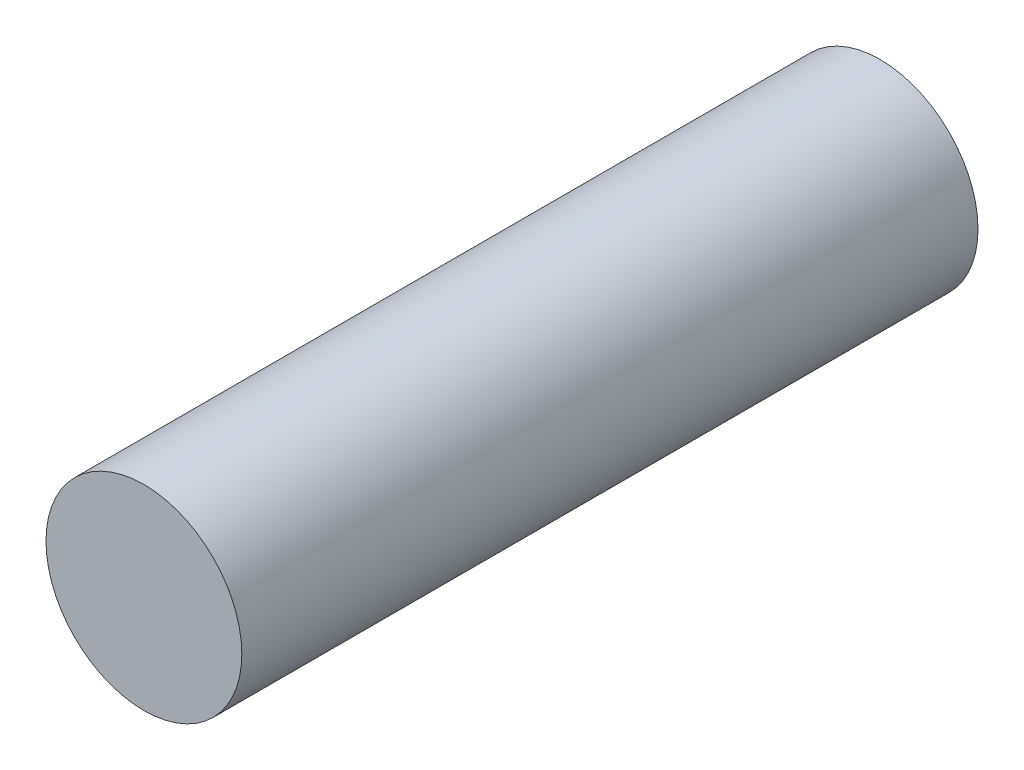
ISO-10303-21;
HEADER;
FILE_DESCRIPTION(('STEP AP214'),'2;1');
FILE_NAME('part.step','',(''),(''),'','','');
FILE_SCHEMA(('AUTOMOTIVE_DESIGN { 1 0 10303 214 1 1 1 1 }'));
ENDSEC;
DATA;
#1=APPLICATION_CONTEXT('core data for automotive mechanical design processes');
#2=APPLICATION_PROTOCOL_DEFINITION('international standard','automotive_design',2000,#1);
#3=PRODUCT_CONTEXT('',#1,'mechanical');
#4=PRODUCT('Part','Part','',(#3));
#5=PRODUCT_RELATED_PRODUCT_CATEGORY('part','',(#4));
#6=PRODUCT_DEFINITION_FORMATION('','',#4);
#7=PRODUCT_DEFINITION_CONTEXT('part definition',#1,'design');
#8=PRODUCT_DEFINITION('design','',#6,#7);
#9=PRODUCT_DEFINITION_SHAPE('','',#8);
#10=(LENGTH_UNIT() NAMED_UNIT(*) SI_UNIT(.MILLI.,.METRE.));
#11=(NAMED_UNIT(*) PLANE_ANGLE_UNIT() SI_UNIT($,.RADIAN.));
#12=(NAMED_UNIT(*) SI_UNIT($,.STERADIAN.) SOLID_ANGLE_UNIT());
#13=UNCERTAINTY_MEASURE_WITH_UNIT(LENGTH_MEASURE(1.E-05),#10,'distance_accuracy_value','');
#14=(GEOMETRIC_REPRESENTATION_CONTEXT(3) GLOBAL_UNCERTAINTY_ASSIGNED_CONTEXT((#13)) GLOBAL_UNIT_ASSIGNED_CONTEXT((#10,
#11,#12)) REPRESENTATION_CONTEXT('',''));
#15=CARTESIAN_POINT('',(0.,0.,0.));
#16=DIRECTION('',(0.,0.,1.));
#17=DIRECTION('',(1.,0.,0.));
#18=AXIS2_PLACEMENT_3D('',#15,#16,#17);
#19=CARTESIAN_POINT('',(-7.80473556806994,1.21600118546991,30.));
#20=DIRECTION('',(0.,0.,-1.));
#21=DIRECTION('',(-1.,0.,0.));
#22=AXIS2_PLACEMENT_3D('',#19,#20,#21);
#23=CYLINDRICAL_SURFACE('',#22,3.99);
#24=CARTESIAN_POINT('',(-7.80473556806994,1.21600118546991,30.));
#25=DIRECTION('',(0.,0.,1.));
#26=DIRECTION('',(1.,0.,0.));
#27=AXIS2_PLACEMENT_3D('',#24,#25,#26);
#28=CIRCLE('',#27,3.99);
#29=CARTESIAN_POINT('',(-3.81473556806994,1.21600118546991,30.));
#30=VERTEX_POINT('',#29);
#31=EDGE_CURVE('E10',#30,#30,#28,.T.);
#32=ORIENTED_EDGE('',*,*,#31,.F.);
#33=EDGE_LOOP('',(#32));
#34=FACE_BOUND('',#33,.T.);
#35=CARTESIAN_POINT('',(-7.80473556806994,1.21600118546991,0.));
#36=DIRECTION('',(0.,0.,1.));
#37=DIRECTION('',(1.,0.,0.));
#38=AXIS2_PLACEMENT_3D('',#35,#36,#37);
#39=CIRCLE('',#38,3.99);
#40=CARTESIAN_POINT('',(-3.81473556806994,1.21600118546991,0.));
#41=VERTEX_POINT('',#40);
#42=EDGE_CURVE('E34',#41,#41,#39,.T.);
#43=ORIENTED_EDGE('',*,*,#42,.T.);
#44=EDGE_LOOP('',(#43));
#45=FACE_BOUND('',#44,.T.);
#46=ADVANCED_FACE('F31',(#34,#45),#23,.T.);
#47=CARTESIAN_POINT('',(-7.80473556806994,1.21600118546991,30.));
#48=DIRECTION('',(0.,0.,1.));
#49=DIRECTION('',(1.,0.,0.));
#50=AXIS2_PLACEMENT_3D('',#47,#48,#49);
#51=PLANE('',#50);
#52=ORIENTED_EDGE('',*,*,#31,.T.);
#53=EDGE_LOOP('',(#52));
#54=FACE_BOUND('',#53,.T.);
#55=ADVANCED_FACE('F46',(#54),#51,.T.);
#56=CARTESIAN_POINT('',(-7.80473556806994,1.21600118546991,0.));
#57=DIRECTION('',(0.,0.,1.));
#58=DIRECTION('',(1.,0.,0.));
#59=AXIS2_PLACEMENT_3D('',#56,#57,#58);
#60=PLANE('',#59);
#61=ORIENTED_EDGE('',*,*,#42,.F.);
#62=EDGE_LOOP('',(#61));
#63=FACE_BOUND('',#62,.T.);
#64=ADVANCED_FACE('F44',(#63),#60,.F.);
#65=CLOSED_SHELL('',(#46,#55,#64));
#66=MANIFOLD_SOLID_BREP('B2',#65);
#67=ADVANCED_BREP_SHAPE_REPRESENTATION('',(#18,#66),#14);
#68=SHAPE_DEFINITION_REPRESENTATION(#9,#67);
ENDSEC;
END-ISO-10303-21;
